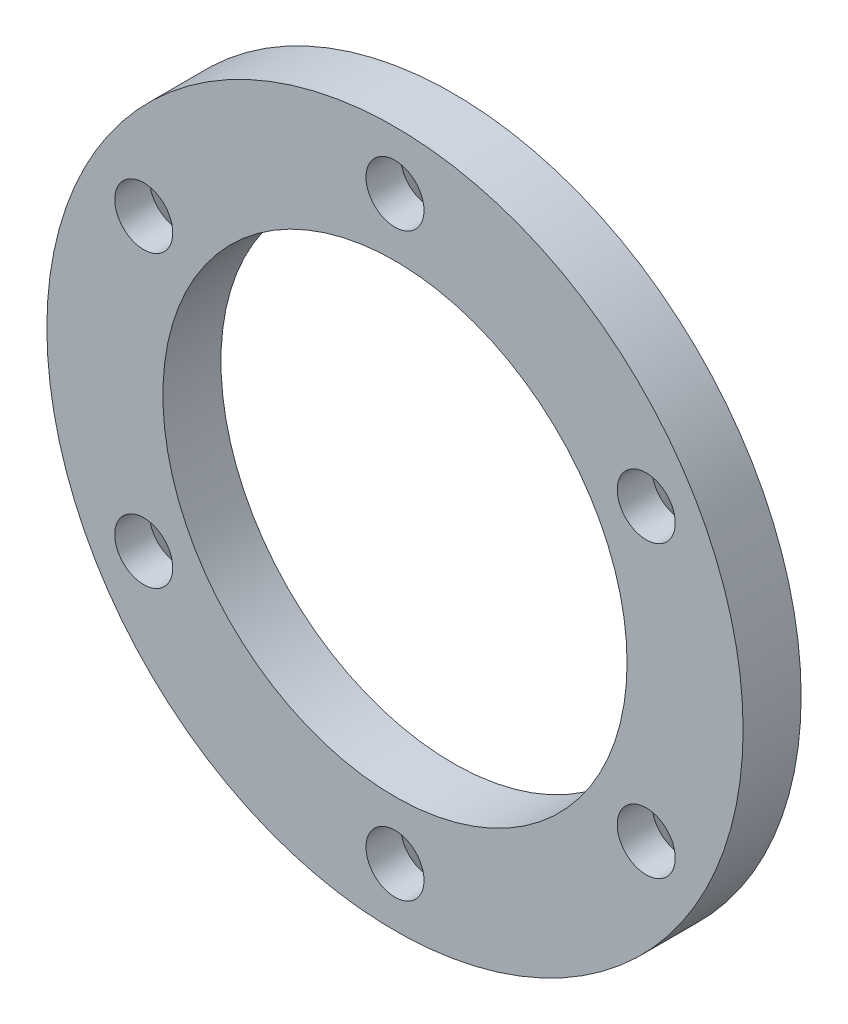
ISO-10303-21;
HEADER;
FILE_DESCRIPTION(('STEP AP214'),'2;1');
FILE_NAME('part.step','',(''),(''),'','','');
FILE_SCHEMA(('AUTOMOTIVE_DESIGN { 1 0 10303 214 1 1 1 1 }'));
ENDSEC;
DATA;
#1=APPLICATION_CONTEXT('core data for automotive mechanical design processes');
#2=APPLICATION_PROTOCOL_DEFINITION('international standard','automotive_design',2000,#1);
#3=PRODUCT_CONTEXT('',#1,'mechanical');
#4=PRODUCT('Part','Part','',(#3));
#5=PRODUCT_RELATED_PRODUCT_CATEGORY('part','',(#4));
#6=PRODUCT_DEFINITION_FORMATION('','',#4);
#7=PRODUCT_DEFINITION_CONTEXT('part definition',#1,'design');
#8=PRODUCT_DEFINITION('design','',#6,#7);
#9=PRODUCT_DEFINITION_SHAPE('','',#8);
#10=(LENGTH_UNIT() NAMED_UNIT(*) SI_UNIT(.MILLI.,.METRE.));
#11=(NAMED_UNIT(*) PLANE_ANGLE_UNIT() SI_UNIT($,.RADIAN.));
#12=(NAMED_UNIT(*) SI_UNIT($,.STERADIAN.) SOLID_ANGLE_UNIT());
#13=UNCERTAINTY_MEASURE_WITH_UNIT(LENGTH_MEASURE(1.E-05),#10,'distance_accuracy_value','');
#14=(GEOMETRIC_REPRESENTATION_CONTEXT(3) GLOBAL_UNCERTAINTY_ASSIGNED_CONTEXT((#13)) GLOBAL_UNIT_ASSIGNED_CONTEXT((#10,
#11,#12)) REPRESENTATION_CONTEXT('',''));
#15=CARTESIAN_POINT('',(0.,0.,0.));
#16=DIRECTION('',(0.,0.,1.));
#17=DIRECTION('',(1.,0.,0.));
#18=AXIS2_PLACEMENT_3D('',#15,#16,#17);
#19=CARTESIAN_POINT('',(0.,0.,5.));
#20=DIRECTION('',(0.,0.,1.));
#21=DIRECTION('',(1.,0.,0.));
#22=AXIS2_PLACEMENT_3D('',#19,#20,#21);
#23=PLANE('',#22);
#24=CARTESIAN_POINT('',(-21.6506350946088,-12.5000000000012,5.));
#25=DIRECTION('',(0.,0.,1.));
#26=DIRECTION('',(1.,0.,0.));
#27=AXIS2_PLACEMENT_3D('',#24,#25,#26);
#28=CIRCLE('',#27,2.50000000000262);
#29=CARTESIAN_POINT('',(-19.1506350946062,-12.5000000000012,5.));
#30=VERTEX_POINT('',#29);
#31=EDGE_CURVE('E98',#30,#30,#28,.T.);
#32=ORIENTED_EDGE('',*,*,#31,.F.);
#33=EDGE_LOOP('',(#32));
#34=FACE_BOUND('',#33,.T.);
#35=CARTESIAN_POINT('',(21.6506350946131,-12.4999999999988,5.));
#36=DIRECTION('',(0.,0.,1.));
#37=DIRECTION('',(1.,0.,0.));
#38=AXIS2_PLACEMENT_3D('',#35,#36,#37);
#39=CIRCLE('',#38,2.50000000000179);
#40=CARTESIAN_POINT('',(24.1506350946149,-12.4999999999988,5.));
#41=VERTEX_POINT('',#40);
#42=EDGE_CURVE('E90',#41,#41,#39,.T.);
#43=ORIENTED_EDGE('',*,*,#42,.F.);
#44=EDGE_LOOP('',(#43));
#45=FACE_BOUND('',#44,.T.);
#46=CARTESIAN_POINT('',(21.6506350946117,12.5000000000012,5.));
#47=DIRECTION('',(0.,0.,1.));
#48=DIRECTION('',(1.,0.,0.));
#49=AXIS2_PLACEMENT_3D('',#46,#47,#48);
#50=CIRCLE('',#49,2.50000000000038);
#51=CARTESIAN_POINT('',(24.1506350946121,12.5000000000012,5.));
#52=VERTEX_POINT('',#51);
#53=EDGE_CURVE('E83',#52,#52,#50,.T.);
#54=ORIENTED_EDGE('',*,*,#53,.F.);
#55=EDGE_LOOP('',(#54));
#56=FACE_BOUND('',#55,.T.);
#57=CARTESIAN_POINT('',(0.,0.,5.));
#58=DIRECTION('',(0.,0.,1.));
#59=DIRECTION('',(1.,0.,0.));
#60=AXIS2_PLACEMENT_3D('',#57,#58,#59);
#61=CIRCLE('',#60,30.);
#62=CARTESIAN_POINT('',(30.,0.,5.));
#63=VERTEX_POINT('',#62);
#64=EDGE_CURVE('E74',#63,#63,#61,.T.);
#65=ORIENTED_EDGE('',*,*,#64,.T.);
#66=EDGE_LOOP('',(#65));
#67=FACE_BOUND('',#66,.T.);
#68=CARTESIAN_POINT('',(0.,25.,5.));
#69=DIRECTION('',(0.,0.,1.));
#70=DIRECTION('',(1.,0.,0.));
#71=AXIS2_PLACEMENT_3D('',#68,#69,#70);
#72=CIRCLE('',#71,2.5);
#73=CARTESIAN_POINT('',(2.5,25.,5.));
#74=VERTEX_POINT('',#73);
#75=EDGE_CURVE('E78',#74,#74,#72,.T.);
#76=ORIENTED_EDGE('',*,*,#75,.F.);
#77=EDGE_LOOP('',(#76));
#78=FACE_BOUND('',#77,.T.);
#79=CARTESIAN_POINT('',(0.,0.,5.));
#80=DIRECTION('',(0.,0.,1.));
#81=DIRECTION('',(1.,0.,0.));
#82=AXIS2_PLACEMENT_3D('',#79,#80,#81);
#83=CIRCLE('',#82,20.);
#84=CARTESIAN_POINT('',(20.,0.,5.));
#85=VERTEX_POINT('',#84);
#86=EDGE_CURVE('E86',#85,#85,#83,.T.);
#87=ORIENTED_EDGE('',*,*,#86,.F.);
#88=EDGE_LOOP('',(#87));
#89=FACE_BOUND('',#88,.T.);
#90=CARTESIAN_POINT('',(2.83604770904466E-12,-25.,5.));
#91=DIRECTION('',(0.,0.,1.));
#92=DIRECTION('',(1.,0.,0.));
#93=AXIS2_PLACEMENT_3D('',#90,#91,#92);
#94=CIRCLE('',#93,2.50000000000288);
#95=CARTESIAN_POINT('',(2.50000000000571,-25.,5.));
#96=VERTEX_POINT('',#95);
#97=EDGE_CURVE('E95',#96,#96,#94,.T.);
#98=ORIENTED_EDGE('',*,*,#97,.F.);
#99=EDGE_LOOP('',(#98));
#100=FACE_BOUND('',#99,.T.);
#101=CARTESIAN_POINT('',(-21.6506350946103,12.4999999999988,5.));
#102=DIRECTION('',(0.,0.,1.));
#103=DIRECTION('',(1.,0.,0.));
#104=AXIS2_PLACEMENT_3D('',#101,#102,#103);
#105=CIRCLE('',#104,2.50000000000133);
#106=CARTESIAN_POINT('',(-19.1506350946089,12.4999999999988,5.));
#107=VERTEX_POINT('',#106);
#108=EDGE_CURVE('E101',#107,#107,#105,.T.);
#109=ORIENTED_EDGE('',*,*,#108,.F.);
#110=EDGE_LOOP('',(#109));
#111=FACE_BOUND('',#110,.T.);
#112=ADVANCED_FACE('F30',(#34,#45,#56,#67,#78,#89,#100,#111),#23,.T.);
#113=CARTESIAN_POINT('',(0.,0.,0.));
#114=DIRECTION('',(0.,0.,1.));
#115=DIRECTION('',(1.,0.,0.));
#116=AXIS2_PLACEMENT_3D('',#113,#114,#115);
#117=PLANE('',#116);
#118=CARTESIAN_POINT('',(-21.6506350946103,12.4999999999988,0.));
#119=DIRECTION('',(0.,0.,1.));
#120=DIRECTION('',(1.,0.,0.));
#121=AXIS2_PLACEMENT_3D('',#118,#119,#120);
#122=CIRCLE('',#121,4.50000000000133);
#123=CARTESIAN_POINT('',(-17.1506350946089,12.4999999999988,0.));
#124=VERTEX_POINT('',#123);
#125=EDGE_CURVE('E56',#124,#124,#122,.T.);
#126=ORIENTED_EDGE('',*,*,#125,.T.);
#127=EDGE_LOOP('',(#126));
#128=FACE_BOUND('',#127,.T.);
#129=CARTESIAN_POINT('',(-21.6506350946088,-12.5000000000012,0.));
#130=DIRECTION('',(0.,0.,1.));
#131=DIRECTION('',(1.,0.,0.));
#132=AXIS2_PLACEMENT_3D('',#129,#130,#131);
#133=CIRCLE('',#132,4.5000000000026);
#134=CARTESIAN_POINT('',(-17.1506350946062,-12.5000000000012,0.));
#135=VERTEX_POINT('',#134);
#136=EDGE_CURVE('E59',#135,#135,#133,.T.);
#137=ORIENTED_EDGE('',*,*,#136,.T.);
#138=EDGE_LOOP('',(#137));
#139=FACE_BOUND('',#138,.T.);
#140=CARTESIAN_POINT('',(2.83604770904466E-12,-25.,0.));
#141=DIRECTION('',(0.,0.,1.));
#142=DIRECTION('',(1.,0.,0.));
#143=AXIS2_PLACEMENT_3D('',#140,#141,#142);
#144=CIRCLE('',#143,4.50000000000286);
#145=CARTESIAN_POINT('',(4.5000000000057,-25.,0.));
#146=VERTEX_POINT('',#145);
#147=EDGE_CURVE('E62',#146,#146,#144,.T.);
#148=ORIENTED_EDGE('',*,*,#147,.T.);
#149=EDGE_LOOP('',(#148));
#150=FACE_BOUND('',#149,.T.);
#151=CARTESIAN_POINT('',(21.6506350946131,-12.4999999999988,0.));
#152=DIRECTION('',(0.,0.,1.));
#153=DIRECTION('',(1.,0.,0.));
#154=AXIS2_PLACEMENT_3D('',#151,#152,#153);
#155=CIRCLE('',#154,4.5000000000018);
#156=CARTESIAN_POINT('',(26.1506350946149,-12.4999999999988,0.));
#157=VERTEX_POINT('',#156);
#158=EDGE_CURVE('E65',#157,#157,#155,.T.);
#159=ORIENTED_EDGE('',*,*,#158,.T.);
#160=EDGE_LOOP('',(#159));
#161=FACE_BOUND('',#160,.T.);
#162=CARTESIAN_POINT('',(21.6506350946117,12.5000000000012,0.));
#163=DIRECTION('',(0.,0.,1.));
#164=DIRECTION('',(1.,0.,0.));
#165=AXIS2_PLACEMENT_3D('',#162,#163,#164);
#166=CIRCLE('',#165,4.50000000000037);
#167=CARTESIAN_POINT('',(26.150635094612,12.5000000000012,0.));
#168=VERTEX_POINT('',#167);
#169=EDGE_CURVE('E68',#168,#168,#166,.T.);
#170=ORIENTED_EDGE('',*,*,#169,.T.);
#171=EDGE_LOOP('',(#170));
#172=FACE_BOUND('',#171,.T.);
#173=CARTESIAN_POINT('',(0.,25.,0.));
#174=DIRECTION('',(0.,0.,1.));
#175=DIRECTION('',(1.,0.,0.));
#176=AXIS2_PLACEMENT_3D('',#173,#174,#175);
#177=CIRCLE('',#176,4.5);
#178=CARTESIAN_POINT('',(4.5,25.,0.));
#179=VERTEX_POINT('',#178);
#180=EDGE_CURVE('E71',#179,#179,#177,.T.);
#181=ORIENTED_EDGE('',*,*,#180,.T.);
#182=EDGE_LOOP('',(#181));
#183=FACE_BOUND('',#182,.T.);
#184=CARTESIAN_POINT('',(0.,0.,0.));
#185=DIRECTION('',(0.,0.,1.));
#186=DIRECTION('',(1.,0.,0.));
#187=AXIS2_PLACEMENT_3D('',#184,#185,#186);
#188=CIRCLE('',#187,30.);
#189=CARTESIAN_POINT('',(30.,0.,0.));
#190=VERTEX_POINT('',#189);
#191=EDGE_CURVE('E75',#190,#190,#188,.T.);
#192=ORIENTED_EDGE('',*,*,#191,.F.);
#193=EDGE_LOOP('',(#192));
#194=FACE_BOUND('',#193,.T.);
#195=CARTESIAN_POINT('',(0.,0.,0.));
#196=DIRECTION('',(0.,0.,1.));
#197=DIRECTION('',(1.,0.,0.));
#198=AXIS2_PLACEMENT_3D('',#195,#196,#197);
#199=CIRCLE('',#198,20.);
#200=CARTESIAN_POINT('',(20.,0.,0.));
#201=VERTEX_POINT('',#200);
#202=EDGE_CURVE('E87',#201,#201,#199,.T.);
#203=ORIENTED_EDGE('',*,*,#202,.T.);
#204=EDGE_LOOP('',(#203));
#205=FACE_BOUND('',#204,.T.);
#206=ADVANCED_FACE('F108',(#128,#139,#150,#161,#172,#183,#194,#205),#117,.F.);
#207=CARTESIAN_POINT('',(0.,0.,5.));
#208=DIRECTION('',(0.,0.,-1.));
#209=DIRECTION('',(-1.,0.,0.));
#210=AXIS2_PLACEMENT_3D('',#207,#208,#209);
#211=CYLINDRICAL_SURFACE('',#210,30.);
#212=ORIENTED_EDGE('',*,*,#64,.F.);
#213=EDGE_LOOP('',(#212));
#214=FACE_BOUND('',#213,.T.);
#215=ORIENTED_EDGE('',*,*,#191,.T.);
#216=EDGE_LOOP('',(#215));
#217=FACE_BOUND('',#216,.T.);
#218=ADVANCED_FACE('F114',(#214,#217),#211,.T.);
#219=CARTESIAN_POINT('',(0.,25.,5.));
#220=DIRECTION('',(0.,0.,-1.));
#221=DIRECTION('',(-1.,0.,0.));
#222=AXIS2_PLACEMENT_3D('',#219,#220,#221);
#223=CYLINDRICAL_SURFACE('',#222,2.5);
#224=CARTESIAN_POINT('',(0.,25.,2.));
#225=DIRECTION('',(0.,0.,1.));
#226=DIRECTION('',(1.,0.,0.));
#227=AXIS2_PLACEMENT_3D('',#224,#225,#226);
#228=CIRCLE('',#227,2.5);
#229=CARTESIAN_POINT('',(2.5,25.,2.));
#230=VERTEX_POINT('',#229);
#231=EDGE_CURVE('E10',#230,#230,#228,.F.);
#232=ORIENTED_EDGE('',*,*,#231,.T.);
#233=EDGE_LOOP('',(#232));
#234=FACE_BOUND('',#233,.T.);
#235=ORIENTED_EDGE('',*,*,#75,.T.);
#236=EDGE_LOOP('',(#235));
#237=FACE_BOUND('',#236,.T.);
#238=ADVANCED_FACE('F120',(#234,#237),#223,.F.);
#239=CARTESIAN_POINT('',(21.6506350946117,12.5000000000012,5.));
#240=DIRECTION('',(0.,0.,-1.));
#241=DIRECTION('',(-1.,0.,0.));
#242=AXIS2_PLACEMENT_3D('',#239,#240,#241);
#243=CYLINDRICAL_SURFACE('',#242,2.50000000000038);
#244=CARTESIAN_POINT('',(21.6506350946117,12.5000000000012,2.));
#245=DIRECTION('',(0.,0.,1.));
#246=DIRECTION('',(1.,0.,0.));
#247=AXIS2_PLACEMENT_3D('',#244,#245,#246);
#248=CIRCLE('',#247,2.50000000000038);
#249=CARTESIAN_POINT('',(24.1506350946121,12.5000000000012,2.));
#250=VERTEX_POINT('',#249);
#251=EDGE_CURVE('E37',#250,#250,#248,.F.);
#252=ORIENTED_EDGE('',*,*,#251,.T.);
#253=EDGE_LOOP('',(#252));
#254=FACE_BOUND('',#253,.T.);
#255=ORIENTED_EDGE('',*,*,#53,.T.);
#256=EDGE_LOOP('',(#255));
#257=FACE_BOUND('',#256,.T.);
#258=ADVANCED_FACE('F161',(#254,#257),#243,.F.);
#259=CARTESIAN_POINT('',(0.,0.,5.));
#260=DIRECTION('',(0.,0.,-1.));
#261=DIRECTION('',(-1.,0.,0.));
#262=AXIS2_PLACEMENT_3D('',#259,#260,#261);
#263=CYLINDRICAL_SURFACE('',#262,20.);
#264=ORIENTED_EDGE('',*,*,#86,.T.);
#265=EDGE_LOOP('',(#264));
#266=FACE_BOUND('',#265,.T.);
#267=ORIENTED_EDGE('',*,*,#202,.F.);
#268=EDGE_LOOP('',(#267));
#269=FACE_BOUND('',#268,.T.);
#270=ADVANCED_FACE('F158',(#266,#269),#263,.F.);
#271=CARTESIAN_POINT('',(21.6506350946131,-12.4999999999988,5.));
#272=DIRECTION('',(0.,0.,-1.));
#273=DIRECTION('',(-1.,0.,0.));
#274=AXIS2_PLACEMENT_3D('',#271,#272,#273);
#275=CYLINDRICAL_SURFACE('',#274,2.50000000000179);
#276=CARTESIAN_POINT('',(21.6506350946131,-12.4999999999988,2.00000000000002));
#277=DIRECTION('',(0.,0.,1.));
#278=DIRECTION('',(1.,0.,0.));
#279=AXIS2_PLACEMENT_3D('',#276,#277,#278);
#280=CIRCLE('',#279,2.50000000000179);
#281=CARTESIAN_POINT('',(24.1506350946149,-12.4999999999988,2.00000000000002));
#282=VERTEX_POINT('',#281);
#283=EDGE_CURVE('E41',#282,#282,#280,.F.);
#284=ORIENTED_EDGE('',*,*,#283,.T.);
#285=EDGE_LOOP('',(#284));
#286=FACE_BOUND('',#285,.T.);
#287=ORIENTED_EDGE('',*,*,#42,.T.);
#288=EDGE_LOOP('',(#287));
#289=FACE_BOUND('',#288,.T.);
#290=ADVANCED_FACE('F160',(#286,#289),#275,.F.);
#291=CARTESIAN_POINT('',(2.83604770904466E-12,-25.,5.));
#292=DIRECTION('',(0.,0.,-1.));
#293=DIRECTION('',(-1.,0.,0.));
#294=AXIS2_PLACEMENT_3D('',#291,#292,#293);
#295=CYLINDRICAL_SURFACE('',#294,2.50000000000288);
#296=CARTESIAN_POINT('',(2.83604770904466E-12,-25.,1.99999999999999));
#297=DIRECTION('',(0.,0.,1.));
#298=DIRECTION('',(1.,0.,0.));
#299=AXIS2_PLACEMENT_3D('',#296,#297,#298);
#300=CIRCLE('',#299,2.50000000000288);
#301=CARTESIAN_POINT('',(2.50000000000571,-25.,1.99999999999999));
#302=VERTEX_POINT('',#301);
#303=EDGE_CURVE('E45',#302,#302,#300,.F.);
#304=ORIENTED_EDGE('',*,*,#303,.T.);
#305=EDGE_LOOP('',(#304));
#306=FACE_BOUND('',#305,.T.);
#307=ORIENTED_EDGE('',*,*,#97,.T.);
#308=EDGE_LOOP('',(#307));
#309=FACE_BOUND('',#308,.T.);
#310=ADVANCED_FACE('F168',(#306,#309),#295,.F.);
#311=CARTESIAN_POINT('',(-21.6506350946088,-12.5000000000012,5.));
#312=DIRECTION('',(0.,0.,-1.));
#313=DIRECTION('',(-1.,0.,0.));
#314=AXIS2_PLACEMENT_3D('',#311,#312,#313);
#315=CYLINDRICAL_SURFACE('',#314,2.50000000000262);
#316=CARTESIAN_POINT('',(-21.6506350946088,-12.5000000000012,1.99999999999999));
#317=DIRECTION('',(0.,0.,1.));
#318=DIRECTION('',(1.,0.,0.));
#319=AXIS2_PLACEMENT_3D('',#316,#317,#318);
#320=CIRCLE('',#319,2.50000000000262);
#321=CARTESIAN_POINT('',(-19.1506350946062,-12.5000000000012,1.99999999999999));
#322=VERTEX_POINT('',#321);
#323=EDGE_CURVE('E50',#322,#322,#320,.F.);
#324=ORIENTED_EDGE('',*,*,#323,.T.);
#325=EDGE_LOOP('',(#324));
#326=FACE_BOUND('',#325,.T.);
#327=ORIENTED_EDGE('',*,*,#31,.T.);
#328=EDGE_LOOP('',(#327));
#329=FACE_BOUND('',#328,.T.);
#330=ADVANCED_FACE('F174',(#326,#329),#315,.F.);
#331=CARTESIAN_POINT('',(-21.6506350946103,12.4999999999988,5.));
#332=DIRECTION('',(0.,0.,-1.));
#333=DIRECTION('',(-1.,0.,0.));
#334=AXIS2_PLACEMENT_3D('',#331,#332,#333);
#335=CYLINDRICAL_SURFACE('',#334,2.50000000000133);
#336=CARTESIAN_POINT('',(-21.6506350946103,12.4999999999988,2.00000000000001));
#337=DIRECTION('',(0.,0.,1.));
#338=DIRECTION('',(1.,0.,0.));
#339=AXIS2_PLACEMENT_3D('',#336,#337,#338);
#340=CIRCLE('',#339,2.50000000000133);
#341=CARTESIAN_POINT('',(-19.1506350946089,12.4999999999988,2.00000000000001));
#342=VERTEX_POINT('',#341);
#343=EDGE_CURVE('E53',#342,#342,#340,.F.);
#344=ORIENTED_EDGE('',*,*,#343,.T.);
#345=EDGE_LOOP('',(#344));
#346=FACE_BOUND('',#345,.T.);
#347=ORIENTED_EDGE('',*,*,#108,.T.);
#348=EDGE_LOOP('',(#347));
#349=FACE_BOUND('',#348,.T.);
#350=ADVANCED_FACE('F105',(#346,#349),#335,.F.);
#351=CARTESIAN_POINT('',(-21.6506350946103,12.4999999999988,0.));
#352=DIRECTION('',(0.,0.,-1.));
#353=DIRECTION('',(-1.,0.,0.));
#354=AXIS2_PLACEMENT_3D('',#351,#352,#353);
#355=CONICAL_SURFACE('',#354,4.50000000000133,0.785398163397445);
#356=ORIENTED_EDGE('',*,*,#343,.F.);
#357=EDGE_LOOP('',(#356));
#358=FACE_BOUND('',#357,.T.);
#359=ORIENTED_EDGE('',*,*,#125,.F.);
#360=EDGE_LOOP('',(#359));
#361=FACE_BOUND('',#360,.T.);
#362=ADVANCED_FACE('F126',(#358,#361),#355,.F.);
#363=CARTESIAN_POINT('',(-21.6506350946088,-12.5000000000012,0.));
#364=DIRECTION('',(0.,0.,-1.));
#365=DIRECTION('',(-1.,0.,0.));
#366=AXIS2_PLACEMENT_3D('',#363,#364,#365);
#367=CONICAL_SURFACE('',#366,4.5000000000026,0.785398163397445);
#368=ORIENTED_EDGE('',*,*,#323,.F.);
#369=EDGE_LOOP('',(#368));
#370=FACE_BOUND('',#369,.T.);
#371=ORIENTED_EDGE('',*,*,#136,.F.);
#372=EDGE_LOOP('',(#371));
#373=FACE_BOUND('',#372,.T.);
#374=ADVANCED_FACE('F129',(#370,#373),#367,.F.);
#375=CARTESIAN_POINT('',(2.83604770904466E-12,-25.,0.));
#376=DIRECTION('',(0.,0.,-1.));
#377=DIRECTION('',(-1.,0.,0.));
#378=AXIS2_PLACEMENT_3D('',#375,#376,#377);
#379=CONICAL_SURFACE('',#378,4.50000000000286,0.785398163397447);
#380=ORIENTED_EDGE('',*,*,#303,.F.);
#381=EDGE_LOOP('',(#380));
#382=FACE_BOUND('',#381,.T.);
#383=ORIENTED_EDGE('',*,*,#147,.F.);
#384=EDGE_LOOP('',(#383));
#385=FACE_BOUND('',#384,.T.);
#386=ADVANCED_FACE('F133',(#382,#385),#379,.F.);
#387=CARTESIAN_POINT('',(21.6506350946131,-12.4999999999988,0.));
#388=DIRECTION('',(0.,0.,-1.));
#389=DIRECTION('',(-1.,0.,0.));
#390=AXIS2_PLACEMENT_3D('',#387,#388,#389);
#391=CONICAL_SURFACE('',#390,4.5000000000018,0.785398163397445);
#392=ORIENTED_EDGE('',*,*,#283,.F.);
#393=EDGE_LOOP('',(#392));
#394=FACE_BOUND('',#393,.T.);
#395=ORIENTED_EDGE('',*,*,#158,.F.);
#396=EDGE_LOOP('',(#395));
#397=FACE_BOUND('',#396,.T.);
#398=ADVANCED_FACE('F137',(#394,#397),#391,.F.);
#399=CARTESIAN_POINT('',(21.6506350946117,12.5000000000012,0.));
#400=DIRECTION('',(0.,0.,-1.));
#401=DIRECTION('',(-1.,0.,0.));
#402=AXIS2_PLACEMENT_3D('',#399,#400,#401);
#403=CONICAL_SURFACE('',#402,4.50000000000037,0.785398163397447);
#404=ORIENTED_EDGE('',*,*,#251,.F.);
#405=EDGE_LOOP('',(#404));
#406=FACE_BOUND('',#405,.T.);
#407=ORIENTED_EDGE('',*,*,#169,.F.);
#408=EDGE_LOOP('',(#407));
#409=FACE_BOUND('',#408,.T.);
#410=ADVANCED_FACE('F140',(#406,#409),#403,.F.);
#411=CARTESIAN_POINT('',(0.,25.,0.));
#412=DIRECTION('',(0.,0.,-1.));
#413=DIRECTION('',(-1.,0.,0.));
#414=AXIS2_PLACEMENT_3D('',#411,#412,#413);
#415=CONICAL_SURFACE('',#414,4.5,0.785398163397447);
#416=ORIENTED_EDGE('',*,*,#231,.F.);
#417=EDGE_LOOP('',(#416));
#418=FACE_BOUND('',#417,.T.);
#419=ORIENTED_EDGE('',*,*,#180,.F.);
#420=EDGE_LOOP('',(#419));
#421=FACE_BOUND('',#420,.T.);
#422=ADVANCED_FACE('F32',(#418,#421),#415,.F.);
#423=CLOSED_SHELL('',(#112,#206,#218,#238,#258,#270,#290,#310,#330,#350,#362,#374,#386,#398,
#410,#422));
#424=MANIFOLD_SOLID_BREP('B2',#423);
#425=ADVANCED_BREP_SHAPE_REPRESENTATION('',(#18,#424),#14);
#426=SHAPE_DEFINITION_REPRESENTATION(#9,#425);
ENDSEC;
END-ISO-10303-21;
